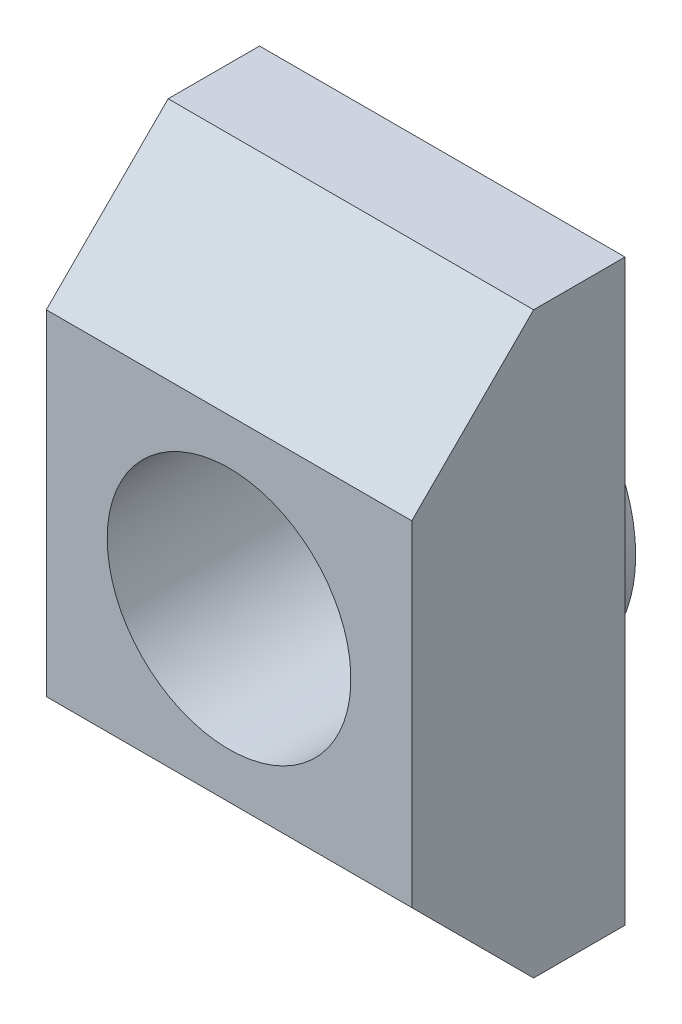
ISO-10303-21;
HEADER;
FILE_DESCRIPTION(('STEP AP214'),'2;1');
FILE_NAME('part.step','',(''),(''),'','','');
FILE_SCHEMA(('AUTOMOTIVE_DESIGN { 1 0 10303 214 1 1 1 1 }'));
ENDSEC;
DATA;
#1=APPLICATION_CONTEXT('core data for automotive mechanical design processes');
#2=APPLICATION_PROTOCOL_DEFINITION('international standard','automotive_design',2000,#1);
#3=PRODUCT_CONTEXT('',#1,'mechanical');
#4=PRODUCT('Part','Part','',(#3));
#5=PRODUCT_RELATED_PRODUCT_CATEGORY('part','',(#4));
#6=PRODUCT_DEFINITION_FORMATION('','',#4);
#7=PRODUCT_DEFINITION_CONTEXT('part definition',#1,'design');
#8=PRODUCT_DEFINITION('design','',#6,#7);
#9=PRODUCT_DEFINITION_SHAPE('','',#8);
#10=(LENGTH_UNIT() NAMED_UNIT(*) SI_UNIT(.MILLI.,.METRE.));
#11=(NAMED_UNIT(*) PLANE_ANGLE_UNIT() SI_UNIT($,.RADIAN.));
#12=(NAMED_UNIT(*) SI_UNIT($,.STERADIAN.) SOLID_ANGLE_UNIT());
#13=UNCERTAINTY_MEASURE_WITH_UNIT(LENGTH_MEASURE(1.E-05),#10,'distance_accuracy_value','');
#14=(GEOMETRIC_REPRESENTATION_CONTEXT(3) GLOBAL_UNCERTAINTY_ASSIGNED_CONTEXT((#13)) GLOBAL_UNIT_ASSIGNED_CONTEXT((#10,
#11,#12)) REPRESENTATION_CONTEXT('',''));
#15=CARTESIAN_POINT('',(0.,0.,0.));
#16=DIRECTION('',(0.,0.,1.));
#17=DIRECTION('',(1.,0.,0.));
#18=AXIS2_PLACEMENT_3D('',#15,#16,#17);
#19=CARTESIAN_POINT('',(0.,0.,2.92902435331399));
#20=DIRECTION('',(0.,0.,-1.));
#21=DIRECTION('',(-1.,0.,0.));
#22=AXIS2_PLACEMENT_3D('',#19,#20,#21);
#23=CYLINDRICAL_SURFACE('',#22,2.);
#24=CARTESIAN_POINT('',(0.,0.,-1.4372505879018));
#25=DIRECTION('',(0.,0.,-1.));
#26=DIRECTION('',(-1.,0.,0.));
#27=AXIS2_PLACEMENT_3D('',#24,#25,#26);
#28=CIRCLE('',#27,2.);
#29=CARTESIAN_POINT('',(-2.,0.,-1.4372505879018));
#30=VERTEX_POINT('',#29);
#31=EDGE_CURVE('E20',#30,#30,#28,.F.);
#32=ORIENTED_EDGE('',*,*,#31,.F.);
#33=EDGE_LOOP('',(#32));
#34=FACE_BOUND('',#33,.T.);
#35=CARTESIAN_POINT('',(0.,0.,2.6627494120982));
#36=DIRECTION('',(0.,0.,-1.));
#37=DIRECTION('',(-1.,0.,0.));
#38=AXIS2_PLACEMENT_3D('',#35,#36,#37);
#39=CIRCLE('',#38,2.);
#40=CARTESIAN_POINT('',(-2.,0.,2.6627494120982));
#41=VERTEX_POINT('',#40);
#42=EDGE_CURVE('E104',#41,#41,#39,.F.);
#43=ORIENTED_EDGE('',*,*,#42,.T.);
#44=EDGE_LOOP('',(#43));
#45=FACE_BOUND('',#44,.T.);
#46=ADVANCED_FACE('F17',(#34,#45),#23,.F.);
#47=CARTESIAN_POINT('',(0.,0.,-1.4372505879018));
#48=DIRECTION('',(0.,0.,-1.));
#49=DIRECTION('',(-1.,0.,0.));
#50=AXIS2_PLACEMENT_3D('',#47,#48,#49);
#51=PLANE('',#50);
#52=ORIENTED_EDGE('',*,*,#31,.T.);
#53=EDGE_LOOP('',(#52));
#54=FACE_BOUND('',#53,.T.);
#55=CARTESIAN_POINT('',(0.,0.,-1.4372505879018));
#56=DIRECTION('',(0.,0.,1.));
#57=DIRECTION('',(1.,0.,0.));
#58=AXIS2_PLACEMENT_3D('',#55,#56,#57);
#59=CIRCLE('',#58,2.57531937284929);
#60=CARTESIAN_POINT('',(2.57531937284929,0.,-1.4372505879018));
#61=VERTEX_POINT('',#60);
#62=EDGE_CURVE('E83',#61,#61,#59,.T.);
#63=ORIENTED_EDGE('',*,*,#62,.F.);
#64=EDGE_LOOP('',(#63));
#65=FACE_BOUND('',#64,.T.);
#66=ADVANCED_FACE('F116',(#54,#65),#51,.T.);
#67=CARTESIAN_POINT('',(3.,4.75,0.662749412098202));
#68=DIRECTION('',(0.,-0.707106781186548,-0.707106781186548));
#69=DIRECTION('',(0.,0.707106781186548,-0.707106781186548));
#70=AXIS2_PLACEMENT_3D('',#67,#68,#69);
#71=PLANE('',#70);
#72=DIRECTION('',(-1.,0.,0.));
#73=VECTOR('',#72,1.);
#74=CARTESIAN_POINT('',(3.,2.75,2.6627494120982));
#75=LINE('',#74,#73);
#76=CARTESIAN_POINT('',(-3.,2.75,2.6627494120982));
#77=VERTEX_POINT('',#76);
#78=CARTESIAN_POINT('',(3.,2.75,2.6627494120982));
#79=VERTEX_POINT('',#78);
#80=EDGE_CURVE('E102',#77,#79,#75,.F.);
#81=ORIENTED_EDGE('',*,*,#80,.T.);
#82=DIRECTION('',(0.,-0.707106781186548,0.707106781186547));
#83=VECTOR('',#82,1.);
#84=CARTESIAN_POINT('',(3.,4.75,0.662749412098202));
#85=LINE('',#84,#83);
#86=CARTESIAN_POINT('',(3.,4.75,0.662749412098202));
#87=VERTEX_POINT('',#86);
#88=EDGE_CURVE('E66',#87,#79,#85,.T.);
#89=ORIENTED_EDGE('',*,*,#88,.F.);
#90=DIRECTION('',(1.,0.,0.));
#91=VECTOR('',#90,1.);
#92=CARTESIAN_POINT('',(3.,4.75,0.662749412098202));
#93=LINE('',#92,#91);
#94=CARTESIAN_POINT('',(-3.,4.75,0.662749412098202));
#95=VERTEX_POINT('',#94);
#96=EDGE_CURVE('E166',#87,#95,#93,.F.);
#97=ORIENTED_EDGE('',*,*,#96,.T.);
#98=DIRECTION('',(0.,-0.707106781186548,0.707106781186547));
#99=VECTOR('',#98,1.);
#100=CARTESIAN_POINT('',(-3.,4.75,0.662749412098202));
#101=LINE('',#100,#99);
#102=EDGE_CURVE('E160',#95,#77,#101,.T.);
#103=ORIENTED_EDGE('',*,*,#102,.T.);
#104=EDGE_LOOP('',(#81,#89,#97,#103));
#105=FACE_BOUND('',#104,.T.);
#106=ADVANCED_FACE('F123',(#105),#71,.F.);
#107=CARTESIAN_POINT('',(3.,2.75,2.6627494120982));
#108=DIRECTION('',(0.,0.,-1.));
#109=DIRECTION('',(-1.,0.,0.));
#110=AXIS2_PLACEMENT_3D('',#107,#108,#109);
#111=PLANE('',#110);
#112=DIRECTION('',(1.,0.,0.));
#113=VECTOR('',#112,1.);
#114=CARTESIAN_POINT('',(3.,-2.75,2.6627494120982));
#115=LINE('',#114,#113);
#116=CARTESIAN_POINT('',(-3.,-2.75,2.6627494120982));
#117=VERTEX_POINT('',#116);
#118=CARTESIAN_POINT('',(3.,-2.75,2.6627494120982));
#119=VERTEX_POINT('',#118);
#120=EDGE_CURVE('E100',#117,#119,#115,.T.);
#121=ORIENTED_EDGE('',*,*,#120,.T.);
#122=DIRECTION('',(0.,1.,0.));
#123=VECTOR('',#122,1.);
#124=CARTESIAN_POINT('',(3.,0.,2.6627494120982));
#125=LINE('',#124,#123);
#126=EDGE_CURVE('E89',#79,#119,#125,.F.);
#127=ORIENTED_EDGE('',*,*,#126,.F.);
#128=ORIENTED_EDGE('',*,*,#80,.F.);
#129=DIRECTION('',(0.,1.,0.));
#130=VECTOR('',#129,1.);
#131=CARTESIAN_POINT('',(-3.,0.,2.6627494120982));
#132=LINE('',#131,#130);
#133=EDGE_CURVE('E170',#77,#117,#132,.F.);
#134=ORIENTED_EDGE('',*,*,#133,.T.);
#135=EDGE_LOOP('',(#121,#127,#128,#134));
#136=FACE_BOUND('',#135,.T.);
#137=ORIENTED_EDGE('',*,*,#42,.F.);
#138=EDGE_LOOP('',(#137));
#139=FACE_BOUND('',#138,.T.);
#140=ADVANCED_FACE('F150',(#136,#139),#111,.F.);
#141=CARTESIAN_POINT('',(3.,-2.75,2.6627494120982));
#142=DIRECTION('',(0.,0.707106781186548,-0.707106781186548));
#143=DIRECTION('',(0.,0.707106781186548,0.707106781186548));
#144=AXIS2_PLACEMENT_3D('',#141,#142,#143);
#145=PLANE('',#144);
#146=DIRECTION('',(1.,0.,0.));
#147=VECTOR('',#146,1.);
#148=CARTESIAN_POINT('',(3.,-4.75,0.662749412098202));
#149=LINE('',#148,#147);
#150=CARTESIAN_POINT('',(-3.,-4.75,0.662749412098201));
#151=VERTEX_POINT('',#150);
#152=CARTESIAN_POINT('',(3.,-4.75,0.662749412098202));
#153=VERTEX_POINT('',#152);
#154=EDGE_CURVE('E72',#151,#153,#149,.T.);
#155=ORIENTED_EDGE('',*,*,#154,.T.);
#156=DIRECTION('',(0.,-0.707106781186548,-0.707106781186547));
#157=VECTOR('',#156,1.);
#158=CARTESIAN_POINT('',(3.,-2.75,2.6627494120982));
#159=LINE('',#158,#157);
#160=EDGE_CURVE('E75',#119,#153,#159,.T.);
#161=ORIENTED_EDGE('',*,*,#160,.F.);
#162=ORIENTED_EDGE('',*,*,#120,.F.);
#163=DIRECTION('',(0.,-0.707106781186548,-0.707106781186547));
#164=VECTOR('',#163,1.);
#165=CARTESIAN_POINT('',(-3.,-2.75,2.6627494120982));
#166=LINE('',#165,#164);
#167=EDGE_CURVE('E77',#117,#151,#166,.T.);
#168=ORIENTED_EDGE('',*,*,#167,.T.);
#169=EDGE_LOOP('',(#155,#161,#162,#168));
#170=FACE_BOUND('',#169,.T.);
#171=ADVANCED_FACE('F74',(#170),#145,.F.);
#172=CARTESIAN_POINT('',(0.,0.,-1.4372505879018));
#173=DIRECTION('',(0.,0.,1.));
#174=DIRECTION('',(1.,0.,0.));
#175=AXIS2_PLACEMENT_3D('',#172,#173,#174);
#176=CYLINDRICAL_SURFACE('',#175,2.57531937284929);
#177=ORIENTED_EDGE('',*,*,#62,.T.);
#178=EDGE_LOOP('',(#177));
#179=FACE_BOUND('',#178,.T.);
#180=CARTESIAN_POINT('',(0.,0.,-0.837250587901798));
#181=DIRECTION('',(0.,0.,1.));
#182=DIRECTION('',(1.,0.,0.));
#183=AXIS2_PLACEMENT_3D('',#180,#181,#182);
#184=CIRCLE('',#183,2.57531937284929);
#185=CARTESIAN_POINT('',(2.57531937284929,0.,-0.837250587901798));
#186=VERTEX_POINT('',#185);
#187=EDGE_CURVE('E105',#186,#186,#184,.F.);
#188=ORIENTED_EDGE('',*,*,#187,.T.);
#189=EDGE_LOOP('',(#188));
#190=FACE_BOUND('',#189,.T.);
#191=ADVANCED_FACE('F144',(#179,#190),#176,.T.);
#192=CARTESIAN_POINT('',(3.,-4.75,0.662749412098202));
#193=DIRECTION('',(0.,1.,0.));
#194=DIRECTION('',(0.,0.,1.));
#195=AXIS2_PLACEMENT_3D('',#192,#193,#194);
#196=PLANE('',#195);
#197=DIRECTION('',(1.,0.,0.));
#198=VECTOR('',#197,1.);
#199=CARTESIAN_POINT('',(3.,-4.75,-0.837250587901798));
#200=LINE('',#199,#198);
#201=CARTESIAN_POINT('',(-3.,-4.75,-0.837250587901798));
#202=VERTEX_POINT('',#201);
#203=CARTESIAN_POINT('',(3.,-4.75,-0.837250587901798));
#204=VERTEX_POINT('',#203);
#205=EDGE_CURVE('E95',#202,#204,#200,.T.);
#206=ORIENTED_EDGE('',*,*,#205,.T.);
#207=DIRECTION('',(0.,0.,-1.));
#208=VECTOR('',#207,1.);
#209=CARTESIAN_POINT('',(3.,-4.75,0.));
#210=LINE('',#209,#208);
#211=EDGE_CURVE('E82',#153,#204,#210,.T.);
#212=ORIENTED_EDGE('',*,*,#211,.F.);
#213=ORIENTED_EDGE('',*,*,#154,.F.);
#214=DIRECTION('',(0.,0.,-1.));
#215=VECTOR('',#214,1.);
#216=CARTESIAN_POINT('',(-3.,-4.75,0.));
#217=LINE('',#216,#215);
#218=EDGE_CURVE('E108',#151,#202,#217,.T.);
#219=ORIENTED_EDGE('',*,*,#218,.T.);
#220=EDGE_LOOP('',(#206,#212,#213,#219));
#221=FACE_BOUND('',#220,.T.);
#222=ADVANCED_FACE('F94',(#221),#196,.F.);
#223=CARTESIAN_POINT('',(3.,0.,0.));
#224=DIRECTION('',(1.,0.,0.));
#225=DIRECTION('',(0.,0.,-1.));
#226=AXIS2_PLACEMENT_3D('',#223,#224,#225);
#227=PLANE('',#226);
#228=ORIENTED_EDGE('',*,*,#126,.T.);
#229=ORIENTED_EDGE('',*,*,#160,.T.);
#230=ORIENTED_EDGE('',*,*,#211,.T.);
#231=DIRECTION('',(0.,1.,0.));
#232=VECTOR('',#231,1.);
#233=CARTESIAN_POINT('',(3.,-4.75,-0.837250587901798));
#234=LINE('',#233,#232);
#235=CARTESIAN_POINT('',(3.,4.75,-0.837250587901798));
#236=VERTEX_POINT('',#235);
#237=EDGE_CURVE('E175',#204,#236,#234,.T.);
#238=ORIENTED_EDGE('',*,*,#237,.T.);
#239=DIRECTION('',(0.,0.,-1.));
#240=VECTOR('',#239,1.);
#241=CARTESIAN_POINT('',(3.,4.75,-0.837250587901798));
#242=LINE('',#241,#240);
#243=EDGE_CURVE('E91',#236,#87,#242,.F.);
#244=ORIENTED_EDGE('',*,*,#243,.T.);
#245=ORIENTED_EDGE('',*,*,#88,.T.);
#246=EDGE_LOOP('',(#228,#229,#230,#238,#244,#245));
#247=FACE_BOUND('',#246,.T.);
#248=ADVANCED_FACE('F85',(#247),#227,.T.);
#249=CARTESIAN_POINT('',(3.,4.75,-0.837250587901798));
#250=DIRECTION('',(0.,-1.,0.));
#251=DIRECTION('',(0.,0.,-1.));
#252=AXIS2_PLACEMENT_3D('',#249,#250,#251);
#253=PLANE('',#252);
#254=ORIENTED_EDGE('',*,*,#96,.F.);
#255=ORIENTED_EDGE('',*,*,#243,.F.);
#256=DIRECTION('',(1.,0.,0.));
#257=VECTOR('',#256,1.);
#258=CARTESIAN_POINT('',(3.,4.75,-0.837250587901798));
#259=LINE('',#258,#257);
#260=CARTESIAN_POINT('',(-3.,4.75,-0.837250587901798));
#261=VERTEX_POINT('',#260);
#262=EDGE_CURVE('E26',#236,#261,#259,.F.);
#263=ORIENTED_EDGE('',*,*,#262,.T.);
#264=DIRECTION('',(0.,0.,-1.));
#265=VECTOR('',#264,1.);
#266=CARTESIAN_POINT('',(-3.,4.75,0.));
#267=LINE('',#266,#265);
#268=EDGE_CURVE('E34',#261,#95,#267,.F.);
#269=ORIENTED_EDGE('',*,*,#268,.T.);
#270=EDGE_LOOP('',(#254,#255,#263,#269));
#271=FACE_BOUND('',#270,.T.);
#272=ADVANCED_FACE('F132',(#271),#253,.F.);
#273=CARTESIAN_POINT('',(-3.,0.,0.));
#274=DIRECTION('',(1.,0.,0.));
#275=DIRECTION('',(0.,0.,-1.));
#276=AXIS2_PLACEMENT_3D('',#273,#274,#275);
#277=PLANE('',#276);
#278=ORIENTED_EDGE('',*,*,#167,.F.);
#279=ORIENTED_EDGE('',*,*,#133,.F.);
#280=ORIENTED_EDGE('',*,*,#102,.F.);
#281=ORIENTED_EDGE('',*,*,#268,.F.);
#282=DIRECTION('',(0.,1.,0.));
#283=VECTOR('',#282,1.);
#284=CARTESIAN_POINT('',(-3.,-4.75,-0.837250587901798));
#285=LINE('',#284,#283);
#286=EDGE_CURVE('E10',#261,#202,#285,.F.);
#287=ORIENTED_EDGE('',*,*,#286,.T.);
#288=ORIENTED_EDGE('',*,*,#218,.F.);
#289=EDGE_LOOP('',(#278,#279,#280,#281,#287,#288));
#290=FACE_BOUND('',#289,.T.);
#291=ADVANCED_FACE('F126',(#290),#277,.F.);
#292=CARTESIAN_POINT('',(3.,-4.75,-0.837250587901798));
#293=DIRECTION('',(0.,0.,1.));
#294=DIRECTION('',(1.,0.,0.));
#295=AXIS2_PLACEMENT_3D('',#292,#293,#294);
#296=PLANE('',#295);
#297=ORIENTED_EDGE('',*,*,#262,.F.);
#298=ORIENTED_EDGE('',*,*,#237,.F.);
#299=ORIENTED_EDGE('',*,*,#205,.F.);
#300=ORIENTED_EDGE('',*,*,#286,.F.);
#301=EDGE_LOOP('',(#297,#298,#299,#300));
#302=FACE_BOUND('',#301,.T.);
#303=ORIENTED_EDGE('',*,*,#187,.F.);
#304=EDGE_LOOP('',(#303));
#305=FACE_BOUND('',#304,.T.);
#306=ADVANCED_FACE('F124',(#302,#305),#296,.F.);
#307=CLOSED_SHELL('',(#46,#66,#106,#140,#171,#191,#222,#248,#272,#291,#306));
#308=MANIFOLD_SOLID_BREP('B1',#307);
#309=ADVANCED_BREP_SHAPE_REPRESENTATION('',(#18,#308),#14);
#310=SHAPE_DEFINITION_REPRESENTATION(#9,#309);
ENDSEC;
END-ISO-10303-21;
